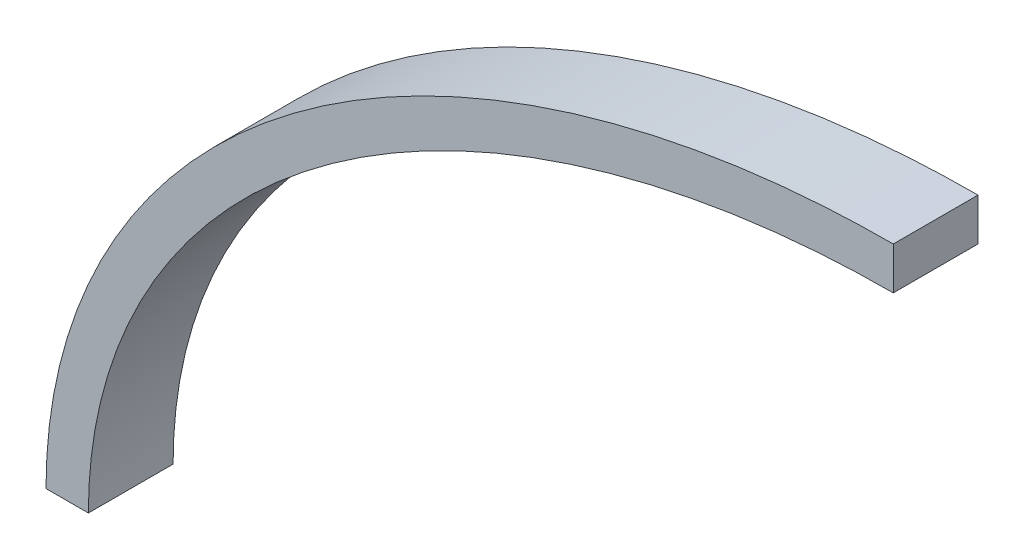
ISO-10303-21;
HEADER;
FILE_DESCRIPTION(('STEP AP214'),'2;1');
FILE_NAME('part.step','',(''),(''),'','','');
FILE_SCHEMA(('AUTOMOTIVE_DESIGN { 1 0 10303 214 1 1 1 1 }'));
ENDSEC;
DATA;
#1=APPLICATION_CONTEXT('core data for automotive mechanical design processes');
#2=APPLICATION_PROTOCOL_DEFINITION('international standard','automotive_design',2000,#1);
#3=PRODUCT_CONTEXT('',#1,'mechanical');
#4=PRODUCT('Part','Part','',(#3));
#5=PRODUCT_RELATED_PRODUCT_CATEGORY('part','',(#4));
#6=PRODUCT_DEFINITION_FORMATION('','',#4);
#7=PRODUCT_DEFINITION_CONTEXT('part definition',#1,'design');
#8=PRODUCT_DEFINITION('design','',#6,#7);
#9=PRODUCT_DEFINITION_SHAPE('','',#8);
#10=(LENGTH_UNIT() NAMED_UNIT(*) SI_UNIT(.MILLI.,.METRE.));
#11=(NAMED_UNIT(*) PLANE_ANGLE_UNIT() SI_UNIT($,.RADIAN.));
#12=(NAMED_UNIT(*) SI_UNIT($,.STERADIAN.) SOLID_ANGLE_UNIT());
#13=UNCERTAINTY_MEASURE_WITH_UNIT(LENGTH_MEASURE(1.E-05),#10,'distance_accuracy_value','');
#14=(GEOMETRIC_REPRESENTATION_CONTEXT(3) GLOBAL_UNCERTAINTY_ASSIGNED_CONTEXT((#13)) GLOBAL_UNIT_ASSIGNED_CONTEXT((#10,
#11,#12)) REPRESENTATION_CONTEXT('',''));
#15=CARTESIAN_POINT('',(0.,0.,0.));
#16=DIRECTION('',(0.,0.,1.));
#17=DIRECTION('',(1.,0.,0.));
#18=AXIS2_PLACEMENT_3D('',#15,#16,#17);
#19=CARTESIAN_POINT('',(-100.,5.2372220082647E-13,10.));
#20=DIRECTION('',(1.03070756206459E-13,1.,0.));
#21=DIRECTION('',(-1.,1.03070756206459E-13,0.));
#22=AXIS2_PLACEMENT_3D('',#19,#20,#21);
#23=PLANE('',#22);
#24=DIRECTION('',(1.,-1.03070756206459E-13,0.));
#25=VECTOR('',#24,1.);
#26=CARTESIAN_POINT('',(-100.,5.2372220082647E-13,0.));
#27=LINE('',#26,#25);
#28=CARTESIAN_POINT('',(-100.,4.90415510087715E-13,0.));
#29=VERTEX_POINT('',#28);
#30=CARTESIAN_POINT('',(-95.,0.,0.));
#31=VERTEX_POINT('',#30);
#32=EDGE_CURVE('E111',#29,#31,#27,.T.);
#33=ORIENTED_EDGE('',*,*,#32,.T.);
#34=DIRECTION('',(0.,0.,-1.));
#35=VECTOR('',#34,1.);
#36=CARTESIAN_POINT('',(-95.,0.,10.));
#37=LINE('',#36,#35);
#38=CARTESIAN_POINT('',(-95.,0.,10.));
#39=VERTEX_POINT('',#38);
#40=EDGE_CURVE('E11',#39,#31,#37,.T.);
#41=ORIENTED_EDGE('',*,*,#40,.F.);
#42=DIRECTION('',(1.,-1.03070756206459E-13,0.));
#43=VECTOR('',#42,1.);
#44=CARTESIAN_POINT('',(-100.,5.2372220082647E-13,10.));
#45=LINE('',#44,#43);
#46=CARTESIAN_POINT('',(-100.,4.90415510087715E-13,10.));
#47=VERTEX_POINT('',#46);
#48=EDGE_CURVE('E89',#47,#39,#45,.T.);
#49=ORIENTED_EDGE('',*,*,#48,.F.);
#50=DIRECTION('',(0.,0.,-1.));
#51=VECTOR('',#50,1.);
#52=CARTESIAN_POINT('',(-100.,4.90415510087715E-13,10.));
#53=LINE('',#52,#51);
#54=EDGE_CURVE('E56',#47,#29,#53,.T.);
#55=ORIENTED_EDGE('',*,*,#54,.T.);
#56=EDGE_LOOP('',(#33,#41,#49,#55));
#57=FACE_BOUND('',#56,.T.);
#58=ADVANCED_FACE('F39',(#57),#23,.F.);
#59=CARTESIAN_POINT('',(-95.,0.,10.));
#60=CARTESIAN_POINT('',(-95.,4.48826268363844,10.));
#61=CARTESIAN_POINT('',(-93.8279908767084,13.410482024392,10.));
#62=CARTESIAN_POINT('',(-88.5757093214026,26.4309510584916,10.));
#63=CARTESIAN_POINT('',(-79.9357903593118,38.5696527180719,10.));
#64=CARTESIAN_POINT('',(-68.1630541496099,49.3409146168486,10.));
#65=CARTESIAN_POINT('',(-53.6760617541772,58.2647403484799,10.));
#66=CARTESIAN_POINT('',(-37.0341050749899,64.940810437389,10.));
#67=CARTESIAN_POINT('',(-21.9201513216866,68.380503469742,10.));
#68=CARTESIAN_POINT('',(-9.4507327612894,69.7678038409092,10.));
#69=CARTESIAN_POINT('',(-3.14659178093124,70.,10.));
#70=CARTESIAN_POINT('',(0.,70.,10.));
#71=B_SPLINE_CURVE_WITH_KNOTS('',3,(#59,#60,#61,#62,#63,#64,#65,#66,#67,#68,#69,#70),
.UNSPECIFIED.,.F.,.F.,(4,1,1,1,1,1,1,1,1,4),(1.5707963267949,1.76714586764426,1.96349540849362,
2.15984494934298,2.35619449019234,2.55254403104171,2.74889357189107,2.94524311274043,
3.04341788316511,3.14159265358979),.UNSPECIFIED.);
#72=DIRECTION('',(0.,0.,-1.));
#73=VECTOR('',#72,1.);
#74=SURFACE_OF_LINEAR_EXTRUSION('',#71,#73);
#75=CARTESIAN_POINT('',(-95.,0.,0.));
#76=CARTESIAN_POINT('',(-95.,4.48826268363844,0.));
#77=CARTESIAN_POINT('',(-93.8279908767084,13.410482024392,0.));
#78=CARTESIAN_POINT('',(-88.5757093214026,26.4309510584916,0.));
#79=CARTESIAN_POINT('',(-79.9357903593118,38.5696527180719,0.));
#80=CARTESIAN_POINT('',(-68.1630541496099,49.3409146168486,0.));
#81=CARTESIAN_POINT('',(-53.6760617541772,58.2647403484799,0.));
#82=CARTESIAN_POINT('',(-37.0341050749899,64.940810437389,0.));
#83=CARTESIAN_POINT('',(-21.9201513216866,68.380503469742,0.));
#84=CARTESIAN_POINT('',(-9.4507327612894,69.7678038409092,0.));
#85=CARTESIAN_POINT('',(-3.14659178093124,70.,0.));
#86=CARTESIAN_POINT('',(0.,70.,0.));
#87=B_SPLINE_CURVE_WITH_KNOTS('',3,(#75,#76,#77,#78,#79,#80,#81,#82,#83,#84,#85,#86),
.UNSPECIFIED.,.F.,.F.,(4,1,1,1,1,1,1,1,1,4),(1.5707963267949,1.76714586764426,1.96349540849362,
2.15984494934298,2.35619449019234,2.55254403104171,2.74889357189107,2.94524311274043,
3.04341788316511,3.14159265358979),.UNSPECIFIED.);
#88=CARTESIAN_POINT('',(0.,70.,0.));
#89=VERTEX_POINT('',#88);
#90=EDGE_CURVE('E95',#31,#89,#87,.T.);
#91=ORIENTED_EDGE('',*,*,#90,.T.);
#92=DIRECTION('',(0.,0.,-1.));
#93=VECTOR('',#92,1.);
#94=CARTESIAN_POINT('',(0.,70.,10.));
#95=LINE('',#94,#93);
#96=CARTESIAN_POINT('',(0.,70.,10.));
#97=VERTEX_POINT('',#96);
#98=EDGE_CURVE('E48',#97,#89,#95,.T.);
#99=ORIENTED_EDGE('',*,*,#98,.F.);
#100=EDGE_CURVE('E81',#39,#97,#71,.T.);
#101=ORIENTED_EDGE('',*,*,#100,.F.);
#102=ORIENTED_EDGE('',*,*,#40,.T.);
#103=EDGE_LOOP('',(#91,#99,#101,#102));
#104=FACE_BOUND('',#103,.T.);
#105=ADVANCED_FACE('F94',(#104),#74,.F.);
#106=CARTESIAN_POINT('',(0.,75.,10.));
#107=DIRECTION('',(1.,0.,0.));
#108=DIRECTION('',(0.,1.,0.));
#109=AXIS2_PLACEMENT_3D('',#106,#107,#108);
#110=PLANE('',#109);
#111=DIRECTION('',(0.,-1.,0.));
#112=VECTOR('',#111,1.);
#113=CARTESIAN_POINT('',(0.,75.,0.));
#114=LINE('',#113,#112);
#115=CARTESIAN_POINT('',(0.,75.,0.));
#116=VERTEX_POINT('',#115);
#117=EDGE_CURVE('E131',#116,#89,#114,.T.);
#118=ORIENTED_EDGE('',*,*,#117,.F.);
#119=DIRECTION('',(0.,0.,-1.));
#120=VECTOR('',#119,1.);
#121=CARTESIAN_POINT('',(0.,75.,10.));
#122=LINE('',#121,#120);
#123=CARTESIAN_POINT('',(0.,75.,10.));
#124=VERTEX_POINT('',#123);
#125=EDGE_CURVE('E70',#124,#116,#122,.T.);
#126=ORIENTED_EDGE('',*,*,#125,.F.);
#127=DIRECTION('',(0.,-1.,0.));
#128=VECTOR('',#127,1.);
#129=CARTESIAN_POINT('',(0.,75.,10.));
#130=LINE('',#129,#128);
#131=EDGE_CURVE('E88',#124,#97,#130,.T.);
#132=ORIENTED_EDGE('',*,*,#131,.T.);
#133=ORIENTED_EDGE('',*,*,#98,.T.);
#134=EDGE_LOOP('',(#118,#126,#132,#133));
#135=FACE_BOUND('',#134,.T.);
#136=ADVANCED_FACE('F99',(#135),#110,.T.);
#137=CARTESIAN_POINT('',(0.,0.,10.));
#138=DIRECTION('',(0.,0.,-1.));
#139=DIRECTION('',(1.,0.,0.));
#140=AXIS2_PLACEMENT_3D('',#137,#138,#139);
#141=ELLIPSE('',#140,100.,75.);
#142=DIRECTION('',(0.,0.,-1.));
#143=VECTOR('',#142,1.);
#144=SURFACE_OF_LINEAR_EXTRUSION('',#141,#143);
#145=CARTESIAN_POINT('',(0.,0.,0.));
#146=DIRECTION('',(0.,0.,-1.));
#147=DIRECTION('',(1.,0.,0.));
#148=AXIS2_PLACEMENT_3D('',#145,#146,#147);
#149=ELLIPSE('',#148,100.,75.);
#150=EDGE_CURVE('E133',#29,#116,#149,.T.);
#151=ORIENTED_EDGE('',*,*,#150,.F.);
#152=ORIENTED_EDGE('',*,*,#54,.F.);
#153=EDGE_CURVE('E101',#47,#124,#141,.T.);
#154=ORIENTED_EDGE('',*,*,#153,.T.);
#155=ORIENTED_EDGE('',*,*,#125,.T.);
#156=EDGE_LOOP('',(#151,#152,#154,#155));
#157=FACE_BOUND('',#156,.T.);
#158=ADVANCED_FACE('F114',(#157),#144,.T.);
#159=CARTESIAN_POINT('',(-67.7106781186548,49.0330085889911,10.));
#160=DIRECTION('',(0.,0.,1.));
#161=DIRECTION('',(1.,0.,0.));
#162=AXIS2_PLACEMENT_3D('',#159,#160,#161);
#163=PLANE('',#162);
#164=ORIENTED_EDGE('',*,*,#48,.T.);
#165=ORIENTED_EDGE('',*,*,#100,.T.);
#166=ORIENTED_EDGE('',*,*,#131,.F.);
#167=ORIENTED_EDGE('',*,*,#153,.F.);
#168=EDGE_LOOP('',(#164,#165,#166,#167));
#169=FACE_BOUND('',#168,.T.);
#170=ADVANCED_FACE('F85',(#169),#163,.T.);
#171=CARTESIAN_POINT('',(-67.7106781186548,49.0330085889911,0.));
#172=DIRECTION('',(0.,0.,1.));
#173=DIRECTION('',(1.,0.,0.));
#174=AXIS2_PLACEMENT_3D('',#171,#172,#173);
#175=PLANE('',#174);
#176=ORIENTED_EDGE('',*,*,#32,.F.);
#177=ORIENTED_EDGE('',*,*,#150,.T.);
#178=ORIENTED_EDGE('',*,*,#117,.T.);
#179=ORIENTED_EDGE('',*,*,#90,.F.);
#180=EDGE_LOOP('',(#176,#177,#178,#179));
#181=FACE_BOUND('',#180,.T.);
#182=ADVANCED_FACE('F118',(#181),#175,.F.);
#183=CLOSED_SHELL('',(#58,#105,#136,#158,#170,#182));
#184=MANIFOLD_SOLID_BREP('B2',#183);
#185=ADVANCED_BREP_SHAPE_REPRESENTATION('',(#18,#184),#14);
#186=SHAPE_DEFINITION_REPRESENTATION(#9,#185);
ENDSEC;
END-ISO-10303-21;
